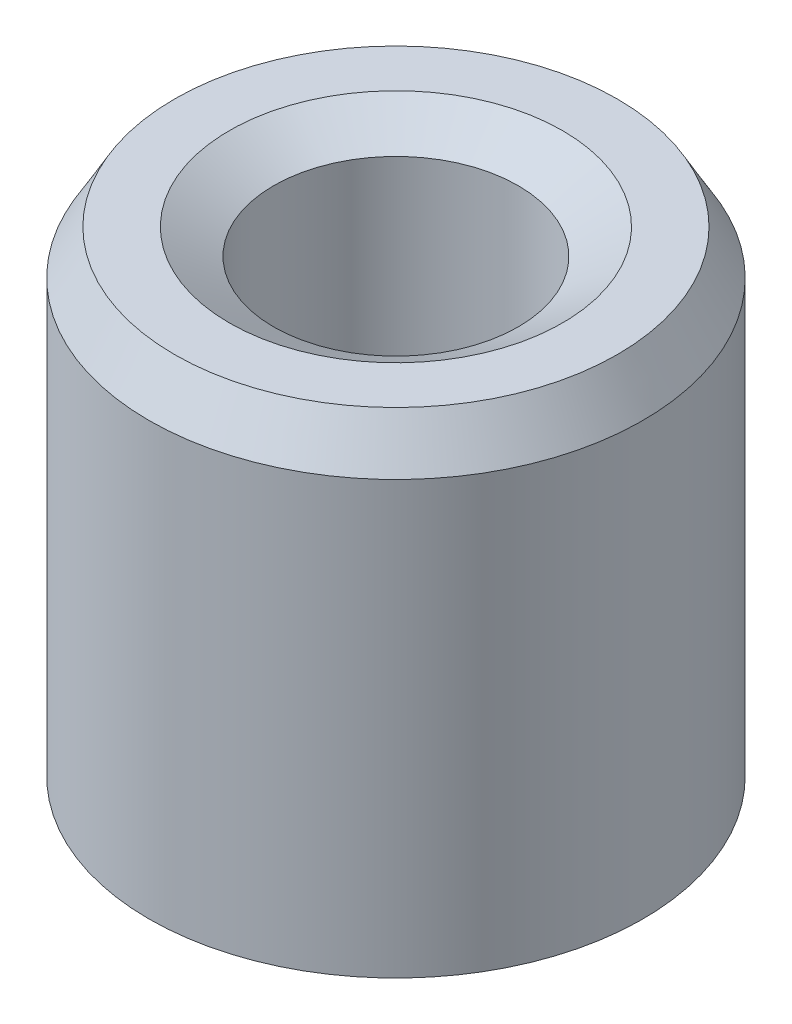
ISO-10303-21;
HEADER;
FILE_DESCRIPTION(('STEP AP214'),'2;1');
FILE_NAME('part.step','',(''),(''),'','','');
FILE_SCHEMA(('AUTOMOTIVE_DESIGN { 1 0 10303 214 1 1 1 1 }'));
ENDSEC;
DATA;
#1=APPLICATION_CONTEXT('core data for automotive mechanical design processes');
#2=APPLICATION_PROTOCOL_DEFINITION('international standard','automotive_design',2000,#1);
#3=PRODUCT_CONTEXT('',#1,'mechanical');
#4=PRODUCT('Part','Part','',(#3));
#5=PRODUCT_RELATED_PRODUCT_CATEGORY('part','',(#4));
#6=PRODUCT_DEFINITION_FORMATION('','',#4);
#7=PRODUCT_DEFINITION_CONTEXT('part definition',#1,'design');
#8=PRODUCT_DEFINITION('design','',#6,#7);
#9=PRODUCT_DEFINITION_SHAPE('','',#8);
#10=(LENGTH_UNIT() NAMED_UNIT(*) SI_UNIT(.MILLI.,.METRE.));
#11=(NAMED_UNIT(*) PLANE_ANGLE_UNIT() SI_UNIT($,.RADIAN.));
#12=(NAMED_UNIT(*) SI_UNIT($,.STERADIAN.) SOLID_ANGLE_UNIT());
#13=UNCERTAINTY_MEASURE_WITH_UNIT(LENGTH_MEASURE(1.E-05),#10,'distance_accuracy_value','');
#14=(GEOMETRIC_REPRESENTATION_CONTEXT(3) GLOBAL_UNCERTAINTY_ASSIGNED_CONTEXT((#13)) GLOBAL_UNIT_ASSIGNED_CONTEXT((#10,
#11,#12)) REPRESENTATION_CONTEXT('',''));
#15=CARTESIAN_POINT('',(0.,0.,0.));
#16=DIRECTION('',(0.,0.,1.));
#17=DIRECTION('',(1.,0.,0.));
#18=AXIS2_PLACEMENT_3D('',#15,#16,#17);
#19=CARTESIAN_POINT('',(0.,35.5438919042056,0.));
#20=DIRECTION('',(0.,-1.,0.));
#21=DIRECTION('',(0.,0.,-1.));
#22=AXIS2_PLACEMENT_3D('',#19,#20,#21);
#23=CYLINDRICAL_SURFACE('',#22,17.5);
#24=CARTESIAN_POINT('',(0.,1.81128859404754,0.));
#25=DIRECTION('',(0.,1.,0.));
#26=DIRECTION('',(0.,0.,1.));
#27=AXIS2_PLACEMENT_3D('',#24,#25,#26);
#28=CIRCLE('',#27,17.5);
#29=CARTESIAN_POINT('',(0.,1.81128859404754,17.5));
#30=VERTEX_POINT('',#29);
#31=EDGE_CURVE('E10',#30,#30,#28,.T.);
#32=ORIENTED_EDGE('',*,*,#31,.T.);
#33=EDGE_LOOP('',(#32));
#34=FACE_BOUND('',#33,.T.);
#35=CARTESIAN_POINT('',(0.,32.4066480321453,0.));
#36=DIRECTION('',(0.,1.,0.));
#37=DIRECTION('',(0.,0.,1.));
#38=AXIS2_PLACEMENT_3D('',#35,#36,#37);
#39=CIRCLE('',#38,17.5);
#40=CARTESIAN_POINT('',(0.,32.4066480321453,17.5));
#41=VERTEX_POINT('',#40);
#42=EDGE_CURVE('E50',#41,#41,#39,.F.);
#43=ORIENTED_EDGE('',*,*,#42,.T.);
#44=EDGE_LOOP('',(#43));
#45=FACE_BOUND('',#44,.T.);
#46=ADVANCED_FACE('F39',(#34,#45),#23,.T.);
#47=CARTESIAN_POINT('',(0.,35.5438919042056,0.));
#48=DIRECTION('',(0.,1.,0.));
#49=DIRECTION('',(0.,0.,1.));
#50=AXIS2_PLACEMENT_3D('',#47,#48,#49);
#51=PLANE('',#50);
#52=CARTESIAN_POINT('',(0.,35.5438919042056,0.));
#53=DIRECTION('',(0.,1.,0.));
#54=DIRECTION('',(0.,0.,1.));
#55=AXIS2_PLACEMENT_3D('',#52,#53,#54);
#56=CIRCLE('',#55,11.8061913405293);
#57=CARTESIAN_POINT('',(0.,35.5438919042056,11.8061913405293));
#58=VERTEX_POINT('',#57);
#59=EDGE_CURVE('E58',#58,#58,#56,.F.);
#60=ORIENTED_EDGE('',*,*,#59,.T.);
#61=EDGE_LOOP('',(#60));
#62=FACE_BOUND('',#61,.T.);
#63=CARTESIAN_POINT('',(0.,35.5438919042056,0.));
#64=DIRECTION('',(0.,1.,0.));
#65=DIRECTION('',(0.,0.,1.));
#66=AXIS2_PLACEMENT_3D('',#63,#64,#65);
#67=CIRCLE('',#66,15.6887114059525);
#68=CARTESIAN_POINT('',(0.,35.5438919042056,15.6887114059525));
#69=VERTEX_POINT('',#68);
#70=EDGE_CURVE('E61',#69,#69,#67,.T.);
#71=ORIENTED_EDGE('',*,*,#70,.T.);
#72=EDGE_LOOP('',(#71));
#73=FACE_BOUND('',#72,.T.);
#74=ADVANCED_FACE('F88',(#62,#73),#51,.T.);
#75=CARTESIAN_POINT('',(0.,0.,0.));
#76=DIRECTION('',(0.,1.,0.));
#77=DIRECTION('',(0.,0.,1.));
#78=AXIS2_PLACEMENT_3D('',#75,#76,#77);
#79=PLANE('',#78);
#80=CARTESIAN_POINT('',(0.,0.,0.));
#81=DIRECTION('',(0.,1.,0.));
#82=DIRECTION('',(0.,0.,1.));
#83=AXIS2_PLACEMENT_3D('',#80,#81,#82);
#84=CIRCLE('',#83,10.4802360625165);
#85=CARTESIAN_POINT('',(0.,0.,10.4802360625165));
#86=VERTEX_POINT('',#85);
#87=EDGE_CURVE('E51',#86,#86,#84,.T.);
#88=ORIENTED_EDGE('',*,*,#87,.T.);
#89=EDGE_LOOP('',(#88));
#90=FACE_BOUND('',#89,.T.);
#91=CARTESIAN_POINT('',(0.,0.,0.));
#92=DIRECTION('',(0.,1.,0.));
#93=DIRECTION('',(0.,0.,1.));
#94=AXIS2_PLACEMENT_3D('',#91,#92,#93);
#95=CIRCLE('',#94,14.3627561279396);
#96=CARTESIAN_POINT('',(0.,0.,14.3627561279396));
#97=VERTEX_POINT('',#96);
#98=EDGE_CURVE('E54',#97,#97,#95,.F.);
#99=ORIENTED_EDGE('',*,*,#98,.T.);
#100=EDGE_LOOP('',(#99));
#101=FACE_BOUND('',#100,.T.);
#102=ADVANCED_FACE('F83',(#90,#101),#79,.F.);
#103=CARTESIAN_POINT('',(0.,35.5438919042056,0.));
#104=DIRECTION('',(0.,-1.,0.));
#105=DIRECTION('',(0.,0.,-1.));
#106=AXIS2_PLACEMENT_3D('',#103,#104,#105);
#107=CYLINDRICAL_SURFACE('',#106,8.66894746846895);
#108=CARTESIAN_POINT('',(0.,33.7326033101581,0.));
#109=DIRECTION('',(0.,1.,0.));
#110=DIRECTION('',(0.,0.,1.));
#111=AXIS2_PLACEMENT_3D('',#108,#109,#110);
#112=CIRCLE('',#111,8.66894746846895);
#113=CARTESIAN_POINT('',(0.,33.7326033101581,8.66894746846895));
#114=VERTEX_POINT('',#113);
#115=EDGE_CURVE('E67',#114,#114,#112,.T.);
#116=ORIENTED_EDGE('',*,*,#115,.T.);
#117=EDGE_LOOP('',(#116));
#118=FACE_BOUND('',#117,.T.);
#119=CARTESIAN_POINT('',(0.,3.13724387206035,0.));
#120=DIRECTION('',(0.,1.,0.));
#121=DIRECTION('',(0.,0.,1.));
#122=AXIS2_PLACEMENT_3D('',#119,#120,#121);
#123=CIRCLE('',#122,8.66894746846895);
#124=CARTESIAN_POINT('',(0.,3.13724387206035,8.66894746846895));
#125=VERTEX_POINT('',#124);
#126=EDGE_CURVE('E69',#125,#125,#123,.F.);
#127=ORIENTED_EDGE('',*,*,#126,.T.);
#128=EDGE_LOOP('',(#127));
#129=FACE_BOUND('',#128,.T.);
#130=ADVANCED_FACE('F71',(#118,#129),#107,.F.);
#131=CARTESIAN_POINT('',(0.,33.7326033101581,0.));
#132=DIRECTION('',(0.,1.,0.));
#133=DIRECTION('',(0.,0.,1.));
#134=AXIS2_PLACEMENT_3D('',#131,#132,#133);
#135=CONICAL_SURFACE('',#134,8.66894746846895,1.0471975511966);
#136=CARTESIAN_POINT('',(0.,35.5438919042056,11.8061913405293));
#137=CARTESIAN_POINT('',(0.,35.5250243146843,11.773511716862));
#138=CARTESIAN_POINT('',(0.,35.506156725163,11.7408320931947));
#139=CARTESIAN_POINT('',(0.,35.4684215461203,11.6754728458601));
#140=CARTESIAN_POINT('',(0.,35.449553956599,11.6427932221928));
#141=CARTESIAN_POINT('',(0.,35.4118187775563,11.5774339748582));
#142=CARTESIAN_POINT('',(0.,35.392951188035,11.5447543511909));
#143=CARTESIAN_POINT('',(0.,35.3552160089923,11.4793951038564));
#144=CARTESIAN_POINT('',(0.,35.336348419471,11.4467154801891));
#145=CARTESIAN_POINT('',(0.,35.2986132404284,11.3813562328545));
#146=CARTESIAN_POINT('',(0.,35.279745650907,11.3486766091872));
#147=CARTESIAN_POINT('',(0.,35.2420104718644,11.2833173618526));
#148=CARTESIAN_POINT('',(0.,35.223142882343,11.2506377381853));
#149=CARTESIAN_POINT('',(0.,35.1854077033004,11.1852784908507));
#150=CARTESIAN_POINT('',(0.,35.166540113779,11.1525988671834));
#151=CARTESIAN_POINT('',(0.,35.1288049347364,11.0872396198488));
#152=CARTESIAN_POINT('',(0.,35.1099373452151,11.0545599961815));
#153=CARTESIAN_POINT('',(0.,35.0722021661724,10.9892007488469));
#154=CARTESIAN_POINT('',(0.,35.0533345766511,10.9565211251796));
#155=CARTESIAN_POINT('',(0.,35.0155993976084,10.891161877845));
#156=CARTESIAN_POINT('',(0.,34.9967318080871,10.8584822541777));
#157=CARTESIAN_POINT('',(0.,34.9589966290444,10.7931230068431));
#158=CARTESIAN_POINT('',(0.,34.9401290395231,10.7604433831759));
#159=CARTESIAN_POINT('',(0.,34.9023938604805,10.6950841358413));
#160=CARTESIAN_POINT('',(0.,34.8835262709591,10.662404512174));
#161=CARTESIAN_POINT('',(0.,34.8457910919165,10.5970452648394));
#162=CARTESIAN_POINT('',(0.,34.8269235023951,10.5643656411721));
#163=CARTESIAN_POINT('',(0.,34.7891883233525,10.4990063938375));
#164=CARTESIAN_POINT('',(0.,34.7703207338312,10.4663267701702));
#165=CARTESIAN_POINT('',(0.,34.7325855547885,10.4009675228356));
#166=CARTESIAN_POINT('',(0.,34.7137179652672,10.3682878991683));
#167=CARTESIAN_POINT('',(0.,34.6759827862245,10.3029286518337));
#168=CARTESIAN_POINT('',(0.,34.6571151967032,10.2702490281664));
#169=CARTESIAN_POINT('',(0.,34.6193800176605,10.2048897808318));
#170=CARTESIAN_POINT('',(0.,34.6005124281392,10.1722101571645));
#171=CARTESIAN_POINT('',(0.,34.5627772490965,10.1068509098299));
#172=CARTESIAN_POINT('',(0.,34.5439096595752,10.0741712861627));
#173=CARTESIAN_POINT('',(0.,34.5061744805326,10.0088120388281));
#174=CARTESIAN_POINT('',(0.,34.4873068910112,9.97613241516076));
#175=CARTESIAN_POINT('',(0.,34.4495717119686,9.91077316782617));
#176=CARTESIAN_POINT('',(0.,34.4307041224472,9.87809354415888));
#177=CARTESIAN_POINT('',(0.,34.3929689434046,9.81273429682429));
#178=CARTESIAN_POINT('',(0.,34.3741013538833,9.78005467315699));
#179=CARTESIAN_POINT('',(0.,34.3363661748406,9.7146954258224));
#180=CARTESIAN_POINT('',(0.,34.3174985853193,9.6820158021551));
#181=CARTESIAN_POINT('',(0.,34.2797634062766,9.61665655482051));
#182=CARTESIAN_POINT('',(0.,34.2608958167553,9.58397693115322));
#183=CARTESIAN_POINT('',(0.,34.2231606377126,9.51861768381863));
#184=CARTESIAN_POINT('',(0.,34.2042930481913,9.48593806015133));
#185=CARTESIAN_POINT('',(0.,34.1665578691486,9.42057881281674));
#186=CARTESIAN_POINT('',(0.,34.1476902796273,9.38789918914945));
#187=CARTESIAN_POINT('',(0.,34.1099551005847,9.32253994181485));
#188=CARTESIAN_POINT('',(0.,34.0910875110633,9.28986031814756));
#189=CARTESIAN_POINT('',(0.,34.0533523320207,9.22450107081297));
#190=CARTESIAN_POINT('',(0.,34.0344847424993,9.19182144714567));
#191=CARTESIAN_POINT('',(0.,33.9967495634567,9.12646219981108));
#192=CARTESIAN_POINT('',(0.,33.9778819739354,9.09378257614379));
#193=CARTESIAN_POINT('',(0.,33.9401467948927,9.0284233288092));
#194=CARTESIAN_POINT('',(0.,33.9212792053714,8.9957437051419));
#195=CARTESIAN_POINT('',(0.,33.8835440263287,8.93038445780731));
#196=CARTESIAN_POINT('',(0.,33.8646764368074,8.89770483414001));
#197=CARTESIAN_POINT('',(0.,33.8269412577647,8.83234558680542));
#198=CARTESIAN_POINT('',(0.,33.8080736682434,8.79966596313813));
#199=CARTESIAN_POINT('',(0.,33.7703384892007,8.73430671580354));
#200=CARTESIAN_POINT('',(0.,33.7514708996794,8.70162709213624));
#201=CARTESIAN_POINT('',(0.,33.7326033101581,8.66894746846895));
#202=B_SPLINE_CURVE_WITH_KNOTS('',3,(#136,#137,#138,#139,#140,#141,#142,#143,#144,#145,#146,
#147,#148,#149,#150,#151,#152,#153,#154,#155,#156,#157,#158,#159,#160,#161,#162,#163,#164,#165,
#166,#167,#168,#169,#170,#171,#172,#173,#174,#175,#176,#177,#178,#179,#180,#181,#182,#183,#184,
#185,#186,#187,#188,#189,#190,#191,#192,#193,#194,#195,#196,#197,#198,#199,#200,#201),
.UNSPECIFIED.,.F.,.F.,(4,2,2,2,2,2,2,2,2,2,2,2,2,2,2,2,2,2,2,2,2,2,2,2,2,2,2,2,2,2,2,2,4),(0.,
0.113205537127973,0.226411074255944,0.339616611383916,0.452822148511889,0.56602768563986,
0.679233222767833,0.792438759895805,0.905644297023777,1.01884983415175,1.13205537127972,
1.24526090840769,1.35846644553566,1.47167198266363,1.58487751979161,1.69808305691958,
1.81128859404755,1.92449413117552,2.0376996683035,2.15090520543147,2.26411074255944,
2.37731627968741,2.49052181681538,2.60372735394335,2.71693289107132,2.8301384281993,
2.94334396532727,3.05654950245524,3.16975503958321,3.28296057671119,3.39616611383916,
3.50937165096713,3.6225771880951),.UNSPECIFIED.);
#203=EDGE_CURVE('BSEAM77',#58,#114,#202,.T.);
#204=ORIENTED_EDGE('',*,*,#59,.F.);
#205=ORIENTED_EDGE('',*,*,#115,.F.);
#206=ORIENTED_EDGE('',*,*,#203,.T.);
#207=ORIENTED_EDGE('',*,*,#203,.F.);
#208=EDGE_LOOP('',(#204,#206,#205,#207));
#209=FACE_BOUND('',#208,.T.);
#210=ADVANCED_FACE('F77',(#209),#135,.F.);
#211=CARTESIAN_POINT('',(0.,0.,0.));
#212=DIRECTION('',(0.,-1.,0.));
#213=DIRECTION('',(0.,0.,-1.));
#214=AXIS2_PLACEMENT_3D('',#211,#212,#213);
#215=CONICAL_SURFACE('',#214,10.4802360625165,0.523598775598296);
#216=ORIENTED_EDGE('',*,*,#126,.F.);
#217=EDGE_LOOP('',(#216));
#218=FACE_BOUND('',#217,.T.);
#219=ORIENTED_EDGE('',*,*,#87,.F.);
#220=EDGE_LOOP('',(#219));
#221=FACE_BOUND('',#220,.T.);
#222=ADVANCED_FACE('F73',(#218,#221),#215,.F.);
#223=CARTESIAN_POINT('',(0.,1.81128859404754,0.));
#224=DIRECTION('',(0.,1.,0.));
#225=DIRECTION('',(0.,0.,1.));
#226=AXIS2_PLACEMENT_3D('',#223,#224,#225);
#227=CONICAL_SURFACE('',#226,17.5,1.0471975511966);
#228=ORIENTED_EDGE('',*,*,#98,.F.);
#229=EDGE_LOOP('',(#228));
#230=FACE_BOUND('',#229,.T.);
#231=ORIENTED_EDGE('',*,*,#31,.F.);
#232=EDGE_LOOP('',(#231));
#233=FACE_BOUND('',#232,.T.);
#234=ADVANCED_FACE('F76',(#230,#233),#227,.T.);
#235=CARTESIAN_POINT('',(0.,35.5438919042056,0.));
#236=DIRECTION('',(0.,-1.,0.));
#237=DIRECTION('',(0.,0.,-1.));
#238=AXIS2_PLACEMENT_3D('',#235,#236,#237);
#239=CONICAL_SURFACE('',#238,15.6887114059525,0.523598775598296);
#240=ORIENTED_EDGE('',*,*,#42,.F.);
#241=EDGE_LOOP('',(#240));
#242=FACE_BOUND('',#241,.T.);
#243=ORIENTED_EDGE('',*,*,#70,.F.);
#244=EDGE_LOOP('',(#243));
#245=FACE_BOUND('',#244,.T.);
#246=ADVANCED_FACE('F45',(#242,#245),#239,.T.);
#247=CLOSED_SHELL('',(#46,#74,#102,#130,#210,#222,#234,#246));
#248=MANIFOLD_SOLID_BREP('B2',#247);
#249=ADVANCED_BREP_SHAPE_REPRESENTATION('',(#18,#248),#14);
#250=SHAPE_DEFINITION_REPRESENTATION(#9,#249);
ENDSEC;
END-ISO-10303-21;
